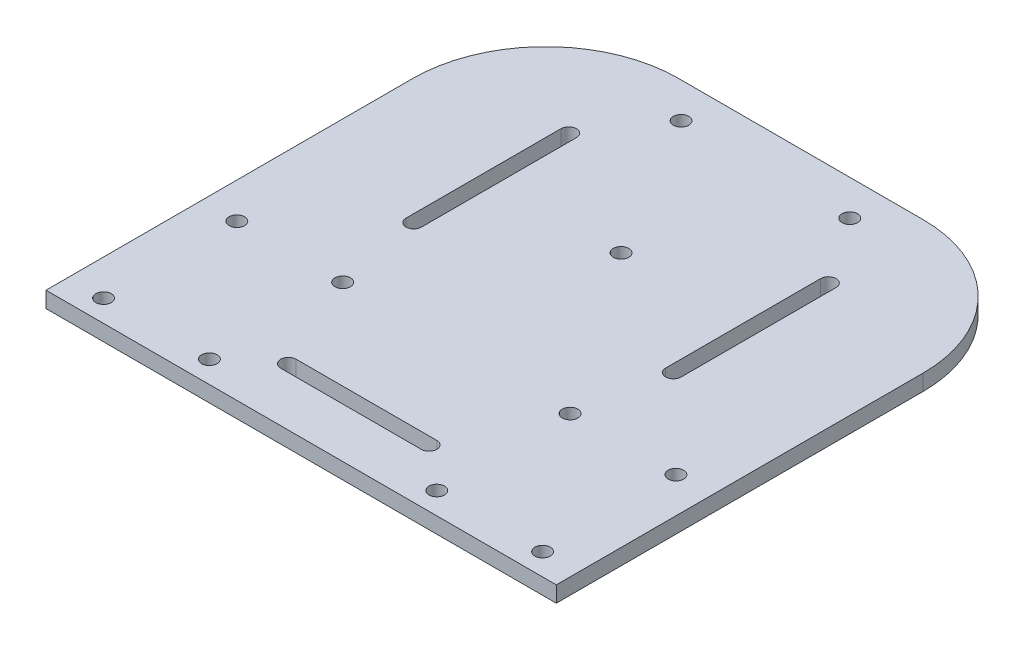
ISO-10303-21;
HEADER;
FILE_DESCRIPTION(('STEP AP214'),'2;1');
FILE_NAME('part.step','',(''),(''),'','','');
FILE_SCHEMA(('AUTOMOTIVE_DESIGN { 1 0 10303 214 1 1 1 1 }'));
ENDSEC;
DATA;
#1=APPLICATION_CONTEXT('core data for automotive mechanical design processes');
#2=APPLICATION_PROTOCOL_DEFINITION('international standard','automotive_design',2000,#1);
#3=PRODUCT_CONTEXT('',#1,'mechanical');
#4=PRODUCT('Part','Part','',(#3));
#5=PRODUCT_RELATED_PRODUCT_CATEGORY('part','',(#4));
#6=PRODUCT_DEFINITION_FORMATION('','',#4);
#7=PRODUCT_DEFINITION_CONTEXT('part definition',#1,'design');
#8=PRODUCT_DEFINITION('design','',#6,#7);
#9=PRODUCT_DEFINITION_SHAPE('','',#8);
#10=(LENGTH_UNIT() NAMED_UNIT(*) SI_UNIT(.MILLI.,.METRE.));
#11=(NAMED_UNIT(*) PLANE_ANGLE_UNIT() SI_UNIT($,.RADIAN.));
#12=(NAMED_UNIT(*) SI_UNIT($,.STERADIAN.) SOLID_ANGLE_UNIT());
#13=UNCERTAINTY_MEASURE_WITH_UNIT(LENGTH_MEASURE(1.E-05),#10,'distance_accuracy_value','');
#14=(GEOMETRIC_REPRESENTATION_CONTEXT(3) GLOBAL_UNCERTAINTY_ASSIGNED_CONTEXT((#13)) GLOBAL_UNIT_ASSIGNED_CONTEXT((#10,
#11,#12)) REPRESENTATION_CONTEXT('',''));
#15=CARTESIAN_POINT('',(0.,0.,0.));
#16=DIRECTION('',(0.,0.,1.));
#17=DIRECTION('',(1.,0.,0.));
#18=AXIS2_PLACEMENT_3D('',#15,#16,#17);
#19=CARTESIAN_POINT('',(122.627455900002,3.6,-110.));
#20=DIRECTION('',(0.,1.,0.));
#21=DIRECTION('',(0.,0.,1.));
#22=AXIS2_PLACEMENT_3D('',#19,#20,#21);
#23=CYLINDRICAL_SURFACE('',#22,30.);
#24=DIRECTION('',(0.,1.,0.));
#25=VECTOR('',#24,1.);
#26=CARTESIAN_POINT('',(152.627455900002,3.6,-110.));
#27=LINE('',#26,#25);
#28=CARTESIAN_POINT('',(152.627455900002,0.,-110.));
#29=VERTEX_POINT('',#28);
#30=CARTESIAN_POINT('',(152.627455900002,3.6,-110.));
#31=VERTEX_POINT('',#30);
#32=EDGE_CURVE('E164',#29,#31,#27,.T.);
#33=ORIENTED_EDGE('',*,*,#32,.F.);
#34=CARTESIAN_POINT('',(122.627455900002,0.,-110.));
#35=DIRECTION('',(0.,1.,0.));
#36=DIRECTION('',(0.,0.,1.));
#37=AXIS2_PLACEMENT_3D('',#34,#35,#36);
#38=CIRCLE('',#37,30.);
#39=CARTESIAN_POINT('',(122.627455900002,0.,-140.));
#40=VERTEX_POINT('',#39);
#41=EDGE_CURVE('E42',#40,#29,#38,.F.);
#42=ORIENTED_EDGE('',*,*,#41,.F.);
#43=DIRECTION('',(0.,1.,0.));
#44=VECTOR('',#43,1.);
#45=CARTESIAN_POINT('',(122.627455900002,3.6,-140.));
#46=LINE('',#45,#44);
#47=CARTESIAN_POINT('',(122.627455900002,3.6,-140.));
#48=VERTEX_POINT('',#47);
#49=EDGE_CURVE('E202',#48,#40,#46,.F.);
#50=ORIENTED_EDGE('',*,*,#49,.F.);
#51=CARTESIAN_POINT('',(122.627455900002,3.6,-110.));
#52=DIRECTION('',(0.,1.,0.));
#53=DIRECTION('',(0.,0.,1.));
#54=AXIS2_PLACEMENT_3D('',#51,#52,#53);
#55=CIRCLE('',#54,30.);
#56=EDGE_CURVE('E11',#31,#48,#55,.T.);
#57=ORIENTED_EDGE('',*,*,#56,.F.);
#58=EDGE_LOOP('',(#33,#42,#50,#57));
#59=FACE_BOUND('',#58,.T.);
#60=ADVANCED_FACE('F35',(#59),#23,.T.);
#61=CARTESIAN_POINT('',(67.372544100005,3.6,-110.));
#62=DIRECTION('',(0.,1.,0.));
#63=DIRECTION('',(0.,0.,1.));
#64=AXIS2_PLACEMENT_3D('',#61,#62,#63);
#65=CYLINDRICAL_SURFACE('',#64,30.);
#66=DIRECTION('',(0.,-1.,0.));
#67=VECTOR('',#66,1.);
#68=CARTESIAN_POINT('',(37.372544100005,3.6,-110.));
#69=LINE('',#68,#67);
#70=CARTESIAN_POINT('',(37.372544100005,3.6,-110.));
#71=VERTEX_POINT('',#70);
#72=CARTESIAN_POINT('',(37.372544100005,0.,-110.));
#73=VERTEX_POINT('',#72);
#74=EDGE_CURVE('E190',#71,#73,#69,.T.);
#75=ORIENTED_EDGE('',*,*,#74,.F.);
#76=CARTESIAN_POINT('',(67.372544100005,3.6,-110.));
#77=DIRECTION('',(0.,1.,0.));
#78=DIRECTION('',(0.,0.,1.));
#79=AXIS2_PLACEMENT_3D('',#76,#77,#78);
#80=CIRCLE('',#79,30.);
#81=CARTESIAN_POINT('',(67.372544100005,3.6,-140.));
#82=VERTEX_POINT('',#81);
#83=EDGE_CURVE('E197',#82,#71,#80,.T.);
#84=ORIENTED_EDGE('',*,*,#83,.F.);
#85=DIRECTION('',(0.,-1.,0.));
#86=VECTOR('',#85,1.);
#87=CARTESIAN_POINT('',(67.372544100005,3.6,-140.));
#88=LINE('',#87,#86);
#89=CARTESIAN_POINT('',(67.372544100005,0.,-140.));
#90=VERTEX_POINT('',#89);
#91=EDGE_CURVE('E193',#90,#82,#88,.F.);
#92=ORIENTED_EDGE('',*,*,#91,.F.);
#93=CARTESIAN_POINT('',(67.372544100005,0.,-110.));
#94=DIRECTION('',(0.,1.,0.));
#95=DIRECTION('',(0.,0.,1.));
#96=AXIS2_PLACEMENT_3D('',#93,#94,#95);
#97=CIRCLE('',#96,30.);
#98=EDGE_CURVE('E199',#73,#90,#97,.F.);
#99=ORIENTED_EDGE('',*,*,#98,.F.);
#100=EDGE_LOOP('',(#75,#84,#92,#99));
#101=FACE_BOUND('',#100,.T.);
#102=ADVANCED_FACE('F402',(#101),#65,.T.);
#103=CARTESIAN_POINT('',(122.570895734623,3.6,-8.26206257174868E-13));
#104=DIRECTION('',(-1.,0.,0.));
#105=DIRECTION('',(0.,0.,1.));
#106=AXIS2_PLACEMENT_3D('',#103,#104,#105);
#107=PLANE('',#106);
#108=DIRECTION('',(0.,0.,-1.));
#109=VECTOR('',#108,1.);
#110=CARTESIAN_POINT('',(122.570895734623,0.,-8.26206257174868E-13));
#111=LINE('',#110,#109);
#112=CARTESIAN_POINT('',(122.570895734622,0.,-81.8932949656048));
#113=VERTEX_POINT('',#112);
#114=CARTESIAN_POINT('',(122.570895734622,0.,-116.893294965605));
#115=VERTEX_POINT('',#114);
#116=EDGE_CURVE('E250',#113,#115,#111,.T.);
#117=ORIENTED_EDGE('',*,*,#116,.T.);
#118=DIRECTION('',(0.,-1.,0.));
#119=VECTOR('',#118,1.);
#120=CARTESIAN_POINT('',(122.570895734622,3.6,-116.893294965605));
#121=LINE('',#120,#119);
#122=CARTESIAN_POINT('',(122.570895734622,3.6,-116.893294965605));
#123=VERTEX_POINT('',#122);
#124=EDGE_CURVE('E194',#123,#115,#121,.T.);
#125=ORIENTED_EDGE('',*,*,#124,.F.);
#126=DIRECTION('',(0.,0.,-1.));
#127=VECTOR('',#126,1.);
#128=CARTESIAN_POINT('',(122.570895734623,3.6,-8.26206257174868E-13));
#129=LINE('',#128,#127);
#130=CARTESIAN_POINT('',(122.570895734622,3.6,-81.8932949656048));
#131=VERTEX_POINT('',#130);
#132=EDGE_CURVE('E354',#131,#123,#129,.T.);
#133=ORIENTED_EDGE('',*,*,#132,.F.);
#134=DIRECTION('',(0.,-1.,0.));
#135=VECTOR('',#134,1.);
#136=CARTESIAN_POINT('',(122.570895734622,3.6,-81.8932949656048));
#137=LINE('',#136,#135);
#138=EDGE_CURVE('E284',#131,#113,#137,.T.);
#139=ORIENTED_EDGE('',*,*,#138,.T.);
#140=EDGE_LOOP('',(#117,#125,#133,#139));
#141=FACE_BOUND('',#140,.T.);
#142=ADVANCED_FACE('F406',(#141),#107,.F.);
#143=CARTESIAN_POINT('',(124.320895734622,3.6,-116.893294965605));
#144=DIRECTION('',(0.,-1.,0.));
#145=DIRECTION('',(0.,0.,-1.));
#146=AXIS2_PLACEMENT_3D('',#143,#144,#145);
#147=CYLINDRICAL_SURFACE('',#146,1.74999999999975);
#148=CARTESIAN_POINT('',(124.320895734622,0.,-116.893294965605));
#149=DIRECTION('',(0.,1.,0.));
#150=DIRECTION('',(0.,0.,1.));
#151=AXIS2_PLACEMENT_3D('',#148,#149,#150);
#152=CIRCLE('',#151,1.74999999999975);
#153=CARTESIAN_POINT('',(126.070895734622,0.,-116.893294965605));
#154=VERTEX_POINT('',#153);
#155=EDGE_CURVE('E253',#115,#154,#152,.F.);
#156=ORIENTED_EDGE('',*,*,#155,.T.);
#157=DIRECTION('',(0.,-1.,0.));
#158=VECTOR('',#157,1.);
#159=CARTESIAN_POINT('',(126.070895734622,3.6,-116.893294965605));
#160=LINE('',#159,#158);
#161=CARTESIAN_POINT('',(126.070895734622,3.6,-116.893294965605));
#162=VERTEX_POINT('',#161);
#163=EDGE_CURVE('E290',#162,#154,#160,.T.);
#164=ORIENTED_EDGE('',*,*,#163,.F.);
#165=CARTESIAN_POINT('',(124.320895734622,3.6,-116.893294965605));
#166=DIRECTION('',(0.,1.,0.));
#167=DIRECTION('',(0.,0.,1.));
#168=AXIS2_PLACEMENT_3D('',#165,#166,#167);
#169=CIRCLE('',#168,1.74999999999975);
#170=EDGE_CURVE('E357',#123,#162,#169,.F.);
#171=ORIENTED_EDGE('',*,*,#170,.F.);
#172=ORIENTED_EDGE('',*,*,#124,.T.);
#173=EDGE_LOOP('',(#156,#164,#171,#172));
#174=FACE_BOUND('',#173,.T.);
#175=ADVANCED_FACE('F411',(#174),#147,.F.);
#176=CARTESIAN_POINT('',(126.070895734622,3.6,-8.99786643298041E-13));
#177=DIRECTION('',(-1.,0.,0.));
#178=DIRECTION('',(0.,0.,1.));
#179=AXIS2_PLACEMENT_3D('',#176,#177,#178);
#180=PLANE('',#179);
#181=DIRECTION('',(0.,0.,-1.));
#182=VECTOR('',#181,1.);
#183=CARTESIAN_POINT('',(126.070895734622,0.,-8.99786643298041E-13));
#184=LINE('',#183,#182);
#185=CARTESIAN_POINT('',(126.070895734622,0.,-81.8932949656048));
#186=VERTEX_POINT('',#185);
#187=EDGE_CURVE('E256',#186,#154,#184,.T.);
#188=ORIENTED_EDGE('',*,*,#187,.F.);
#189=DIRECTION('',(0.,-1.,0.));
#190=VECTOR('',#189,1.);
#191=CARTESIAN_POINT('',(126.070895734622,3.6,-81.8932949656048));
#192=LINE('',#191,#190);
#193=CARTESIAN_POINT('',(126.070895734622,3.6,-81.8932949656048));
#194=VERTEX_POINT('',#193);
#195=EDGE_CURVE('E287',#194,#186,#192,.T.);
#196=ORIENTED_EDGE('',*,*,#195,.F.);
#197=DIRECTION('',(0.,0.,-1.));
#198=VECTOR('',#197,1.);
#199=CARTESIAN_POINT('',(126.070895734622,3.6,-8.99786643298041E-13));
#200=LINE('',#199,#198);
#201=EDGE_CURVE('E359',#194,#162,#200,.T.);
#202=ORIENTED_EDGE('',*,*,#201,.T.);
#203=ORIENTED_EDGE('',*,*,#163,.T.);
#204=EDGE_LOOP('',(#188,#196,#202,#203));
#205=FACE_BOUND('',#204,.T.);
#206=ADVANCED_FACE('F452',(#205),#180,.T.);
#207=CARTESIAN_POINT('',(65.6791042653779,3.6,-116.893294965605));
#208=DIRECTION('',(0.,-1.,0.));
#209=DIRECTION('',(0.,0.,-1.));
#210=AXIS2_PLACEMENT_3D('',#207,#208,#209);
#211=CYLINDRICAL_SURFACE('',#210,1.74999999999975);
#212=CARTESIAN_POINT('',(65.6791042653779,0.,-116.893294965605));
#213=DIRECTION('',(0.,1.,0.));
#214=DIRECTION('',(0.,0.,1.));
#215=AXIS2_PLACEMENT_3D('',#212,#213,#214);
#216=CIRCLE('',#215,1.74999999999975);
#217=CARTESIAN_POINT('',(67.4291042653776,0.,-116.893294965605));
#218=VERTEX_POINT('',#217);
#219=CARTESIAN_POINT('',(63.9291042653781,0.,-116.893294965605));
#220=VERTEX_POINT('',#219);
#221=EDGE_CURVE('E235',#218,#220,#216,.T.);
#222=ORIENTED_EDGE('',*,*,#221,.F.);
#223=DIRECTION('',(0.,-1.,0.));
#224=VECTOR('',#223,1.);
#225=CARTESIAN_POINT('',(67.4291042653776,3.6,-116.893294965605));
#226=LINE('',#225,#224);
#227=CARTESIAN_POINT('',(67.4291042653776,3.6,-116.893294965605));
#228=VERTEX_POINT('',#227);
#229=EDGE_CURVE('E288',#228,#218,#226,.T.);
#230=ORIENTED_EDGE('',*,*,#229,.F.);
#231=CARTESIAN_POINT('',(65.6791042653779,3.6,-116.893294965605));
#232=DIRECTION('',(0.,1.,0.));
#233=DIRECTION('',(0.,0.,1.));
#234=AXIS2_PLACEMENT_3D('',#231,#232,#233);
#235=CIRCLE('',#234,1.74999999999975);
#236=CARTESIAN_POINT('',(63.9291042653781,3.6,-116.893294965605));
#237=VERTEX_POINT('',#236);
#238=EDGE_CURVE('E340',#228,#237,#235,.T.);
#239=ORIENTED_EDGE('',*,*,#238,.T.);
#240=DIRECTION('',(0.,-1.,0.));
#241=VECTOR('',#240,1.);
#242=CARTESIAN_POINT('',(63.9291042653781,3.6,-116.893294965605));
#243=LINE('',#242,#241);
#244=EDGE_CURVE('E294',#237,#220,#243,.T.);
#245=ORIENTED_EDGE('',*,*,#244,.T.);
#246=EDGE_LOOP('',(#222,#230,#239,#245));
#247=FACE_BOUND('',#246,.T.);
#248=ADVANCED_FACE('F448',(#247),#211,.F.);
#249=CARTESIAN_POINT('',(67.4291042653776,3.6,0.));
#250=DIRECTION('',(-1.,0.,0.));
#251=DIRECTION('',(0.,0.,1.));
#252=AXIS2_PLACEMENT_3D('',#249,#250,#251);
#253=PLANE('',#252);
#254=DIRECTION('',(0.,0.,-1.));
#255=VECTOR('',#254,1.);
#256=CARTESIAN_POINT('',(67.4291042653776,0.,0.));
#257=LINE('',#256,#255);
#258=CARTESIAN_POINT('',(67.4291042653776,0.,-81.8932949656048));
#259=VERTEX_POINT('',#258);
#260=EDGE_CURVE('E238',#259,#218,#257,.T.);
#261=ORIENTED_EDGE('',*,*,#260,.F.);
#262=DIRECTION('',(0.,-1.,0.));
#263=VECTOR('',#262,1.);
#264=CARTESIAN_POINT('',(67.4291042653776,3.6,-81.8932949656048));
#265=LINE('',#264,#263);
#266=CARTESIAN_POINT('',(67.4291042653776,3.6,-81.8932949656048));
#267=VERTEX_POINT('',#266);
#268=EDGE_CURVE('E299',#267,#259,#265,.T.);
#269=ORIENTED_EDGE('',*,*,#268,.F.);
#270=DIRECTION('',(0.,0.,-1.));
#271=VECTOR('',#270,1.);
#272=CARTESIAN_POINT('',(67.4291042653776,3.6,0.));
#273=LINE('',#272,#271);
#274=EDGE_CURVE('E343',#267,#228,#273,.T.);
#275=ORIENTED_EDGE('',*,*,#274,.T.);
#276=ORIENTED_EDGE('',*,*,#229,.T.);
#277=EDGE_LOOP('',(#261,#269,#275,#276));
#278=FACE_BOUND('',#277,.T.);
#279=ADVANCED_FACE('F451',(#278),#253,.T.);
#280=CARTESIAN_POINT('',(65.6791042653779,3.6,-81.8932949656048));
#281=DIRECTION('',(0.,-1.,0.));
#282=DIRECTION('',(0.,0.,-1.));
#283=AXIS2_PLACEMENT_3D('',#280,#281,#282);
#284=CYLINDRICAL_SURFACE('',#283,1.74999999999975);
#285=CARTESIAN_POINT('',(65.6791042653779,0.,-81.8932949656048));
#286=DIRECTION('',(0.,1.,0.));
#287=DIRECTION('',(0.,0.,1.));
#288=AXIS2_PLACEMENT_3D('',#285,#286,#287);
#289=CIRCLE('',#288,1.74999999999975);
#290=CARTESIAN_POINT('',(63.9291042653781,0.,-81.8932949656048));
#291=VERTEX_POINT('',#290);
#292=EDGE_CURVE('E241',#291,#259,#289,.T.);
#293=ORIENTED_EDGE('',*,*,#292,.F.);
#294=DIRECTION('',(0.,-1.,0.));
#295=VECTOR('',#294,1.);
#296=CARTESIAN_POINT('',(63.9291042653781,3.6,-81.8932949656048));
#297=LINE('',#296,#295);
#298=CARTESIAN_POINT('',(63.9291042653781,3.6,-81.8932949656048));
#299=VERTEX_POINT('',#298);
#300=EDGE_CURVE('E296',#299,#291,#297,.T.);
#301=ORIENTED_EDGE('',*,*,#300,.F.);
#302=CARTESIAN_POINT('',(65.6791042653779,3.6,-81.8932949656048));
#303=DIRECTION('',(0.,1.,0.));
#304=DIRECTION('',(0.,0.,1.));
#305=AXIS2_PLACEMENT_3D('',#302,#303,#304);
#306=CIRCLE('',#305,1.74999999999975);
#307=EDGE_CURVE('E346',#299,#267,#306,.T.);
#308=ORIENTED_EDGE('',*,*,#307,.T.);
#309=ORIENTED_EDGE('',*,*,#268,.T.);
#310=EDGE_LOOP('',(#293,#301,#308,#309));
#311=FACE_BOUND('',#310,.T.);
#312=ADVANCED_FACE('F431',(#311),#284,.F.);
#313=CARTESIAN_POINT('',(110.877455899999,3.6,-40.1432949656277));
#314=DIRECTION('',(0.,-1.,0.));
#315=DIRECTION('',(0.,0.,-1.));
#316=AXIS2_PLACEMENT_3D('',#313,#314,#315);
#317=CYLINDRICAL_SURFACE('',#316,1.75000000000342);
#318=CARTESIAN_POINT('',(110.877455899999,0.,-40.1432949656277));
#319=DIRECTION('',(0.,1.,0.));
#320=DIRECTION('',(0.,0.,1.));
#321=AXIS2_PLACEMENT_3D('',#318,#319,#320);
#322=CIRCLE('',#321,1.75000000000342);
#323=CARTESIAN_POINT('',(110.877455899999,0.,-38.3932949656243));
#324=VERTEX_POINT('',#323);
#325=CARTESIAN_POINT('',(110.877455899999,0.,-41.8932949656311));
#326=VERTEX_POINT('',#325);
#327=EDGE_CURVE('E217',#324,#326,#322,.T.);
#328=ORIENTED_EDGE('',*,*,#327,.F.);
#329=DIRECTION('',(0.,-1.,0.));
#330=VECTOR('',#329,1.);
#331=CARTESIAN_POINT('',(110.877455899999,3.6,-38.3932949656243));
#332=LINE('',#331,#330);
#333=CARTESIAN_POINT('',(110.877455899999,3.6,-38.3932949656243));
#334=VERTEX_POINT('',#333);
#335=EDGE_CURVE('E297',#334,#324,#332,.T.);
#336=ORIENTED_EDGE('',*,*,#335,.F.);
#337=CARTESIAN_POINT('',(110.877455899999,3.6,-40.1432949656277));
#338=DIRECTION('',(0.,1.,0.));
#339=DIRECTION('',(0.,0.,1.));
#340=AXIS2_PLACEMENT_3D('',#337,#338,#339);
#341=CIRCLE('',#340,1.75000000000342);
#342=CARTESIAN_POINT('',(110.877455899999,3.6,-41.8932949656311));
#343=VERTEX_POINT('',#342);
#344=EDGE_CURVE('E326',#334,#343,#341,.T.);
#345=ORIENTED_EDGE('',*,*,#344,.T.);
#346=DIRECTION('',(0.,-1.,0.));
#347=VECTOR('',#346,1.);
#348=CARTESIAN_POINT('',(110.877455899999,3.6,-41.8932949656311));
#349=LINE('',#348,#347);
#350=EDGE_CURVE('E181',#343,#326,#349,.T.);
#351=ORIENTED_EDGE('',*,*,#350,.T.);
#352=EDGE_LOOP('',(#328,#336,#345,#351));
#353=FACE_BOUND('',#352,.T.);
#354=ADVANCED_FACE('F314',(#353),#317,.F.);
#355=CARTESIAN_POINT('',(0.,3.6,-38.3932949656243));
#356=DIRECTION('',(0.,0.,-1.));
#357=DIRECTION('',(-1.,0.,0.));
#358=AXIS2_PLACEMENT_3D('',#355,#356,#357);
#359=PLANE('',#358);
#360=DIRECTION('',(1.,0.,0.));
#361=VECTOR('',#360,1.);
#362=CARTESIAN_POINT('',(0.,0.,-38.3932949656243));
#363=LINE('',#362,#361);
#364=CARTESIAN_POINT('',(79.1225441000075,0.,-38.3932949656243));
#365=VERTEX_POINT('',#364);
#366=EDGE_CURVE('E220',#365,#324,#363,.T.);
#367=ORIENTED_EDGE('',*,*,#366,.F.);
#368=DIRECTION('',(0.,-1.,0.));
#369=VECTOR('',#368,1.);
#370=CARTESIAN_POINT('',(79.1225441000075,3.6,-38.3932949656243));
#371=LINE('',#370,#369);
#372=CARTESIAN_POINT('',(79.1225441000075,3.6,-38.3932949656243));
#373=VERTEX_POINT('',#372);
#374=EDGE_CURVE('E303',#373,#365,#371,.T.);
#375=ORIENTED_EDGE('',*,*,#374,.F.);
#376=DIRECTION('',(1.,0.,0.));
#377=VECTOR('',#376,1.);
#378=CARTESIAN_POINT('',(0.,3.6,-38.3932949656243));
#379=LINE('',#378,#377);
#380=EDGE_CURVE('E310',#373,#334,#379,.T.);
#381=ORIENTED_EDGE('',*,*,#380,.T.);
#382=ORIENTED_EDGE('',*,*,#335,.T.);
#383=EDGE_LOOP('',(#367,#375,#381,#382));
#384=FACE_BOUND('',#383,.T.);
#385=ADVANCED_FACE('F308',(#384),#359,.T.);
#386=CARTESIAN_POINT('',(79.1225441000075,3.6,-40.1432949656277));
#387=DIRECTION('',(0.,-1.,0.));
#388=DIRECTION('',(0.,0.,-1.));
#389=AXIS2_PLACEMENT_3D('',#386,#387,#388);
#390=CYLINDRICAL_SURFACE('',#389,1.75000000000342);
#391=CARTESIAN_POINT('',(79.1225441000075,0.,-40.1432949656277));
#392=DIRECTION('',(0.,1.,0.));
#393=DIRECTION('',(0.,0.,1.));
#394=AXIS2_PLACEMENT_3D('',#391,#392,#393);
#395=CIRCLE('',#394,1.75000000000342);
#396=CARTESIAN_POINT('',(79.1225441000075,0.,-41.8932949656311));
#397=VERTEX_POINT('',#396);
#398=EDGE_CURVE('E223',#397,#365,#395,.T.);
#399=ORIENTED_EDGE('',*,*,#398,.F.);
#400=DIRECTION('',(0.,-1.,0.));
#401=VECTOR('',#400,1.);
#402=CARTESIAN_POINT('',(79.1225441000075,3.6,-41.8932949656311));
#403=LINE('',#402,#401);
#404=CARTESIAN_POINT('',(79.1225441000075,3.6,-41.8932949656311));
#405=VERTEX_POINT('',#404);
#406=EDGE_CURVE('E184',#405,#397,#403,.T.);
#407=ORIENTED_EDGE('',*,*,#406,.F.);
#408=CARTESIAN_POINT('',(79.1225441000075,3.6,-40.1432949656277));
#409=DIRECTION('',(0.,1.,0.));
#410=DIRECTION('',(0.,0.,1.));
#411=AXIS2_PLACEMENT_3D('',#408,#409,#410);
#412=CIRCLE('',#411,1.75000000000342);
#413=EDGE_CURVE('E324',#405,#373,#412,.T.);
#414=ORIENTED_EDGE('',*,*,#413,.T.);
#415=ORIENTED_EDGE('',*,*,#374,.T.);
#416=EDGE_LOOP('',(#399,#407,#414,#415));
#417=FACE_BOUND('',#416,.T.);
#418=ADVANCED_FACE('F320',(#417),#390,.F.);
#419=CARTESIAN_POINT('',(0.,3.6,-27.1432949656277));
#420=DIRECTION('',(0.,0.,-1.));
#421=DIRECTION('',(-1.,0.,0.));
#422=AXIS2_PLACEMENT_3D('',#419,#420,#421);
#423=PLANE('',#422);
#424=DIRECTION('',(1.,0.,0.));
#425=VECTOR('',#424,1.);
#426=CARTESIAN_POINT('',(0.,0.,-27.1432949656277));
#427=LINE('',#426,#425);
#428=CARTESIAN_POINT('',(37.372544100005,0.,-27.1432949656277));
#429=VERTEX_POINT('',#428);
#430=CARTESIAN_POINT('',(152.627455900002,0.,-27.1432949656277));
#431=VERTEX_POINT('',#430);
#432=EDGE_CURVE('E180',#429,#431,#427,.T.);
#433=ORIENTED_EDGE('',*,*,#432,.T.);
#434=DIRECTION('',(0.,-1.,0.));
#435=VECTOR('',#434,1.);
#436=CARTESIAN_POINT('',(152.627455900002,3.6,-27.1432949656277));
#437=LINE('',#436,#435);
#438=CARTESIAN_POINT('',(152.627455900002,3.6,-27.1432949656277));
#439=VERTEX_POINT('',#438);
#440=EDGE_CURVE('E162',#439,#431,#437,.T.);
#441=ORIENTED_EDGE('',*,*,#440,.F.);
#442=DIRECTION('',(1.,0.,0.));
#443=VECTOR('',#442,1.);
#444=CARTESIAN_POINT('',(0.,3.6,-27.1432949656277));
#445=LINE('',#444,#443);
#446=CARTESIAN_POINT('',(37.372544100005,3.6,-27.1432949656277));
#447=VERTEX_POINT('',#446);
#448=EDGE_CURVE('E166',#447,#439,#445,.T.);
#449=ORIENTED_EDGE('',*,*,#448,.F.);
#450=DIRECTION('',(0.,-1.,0.));
#451=VECTOR('',#450,1.);
#452=CARTESIAN_POINT('',(37.372544100005,3.6,-27.1432949656277));
#453=LINE('',#452,#451);
#454=EDGE_CURVE('E182',#447,#429,#453,.T.);
#455=ORIENTED_EDGE('',*,*,#454,.T.);
#456=EDGE_LOOP('',(#433,#441,#449,#455));
#457=FACE_BOUND('',#456,.T.);
#458=ADVANCED_FACE('F178',(#457),#423,.F.);
#459=CARTESIAN_POINT('',(152.627455900002,3.6,0.));
#460=DIRECTION('',(1.,0.,0.));
#461=DIRECTION('',(0.,0.,-1.));
#462=AXIS2_PLACEMENT_3D('',#459,#460,#461);
#463=PLANE('',#462);
#464=DIRECTION('',(0.,0.,1.));
#465=VECTOR('',#464,1.);
#466=CARTESIAN_POINT('',(152.627455900002,0.,0.));
#467=LINE('',#466,#465);
#468=EDGE_CURVE('E207',#29,#431,#467,.T.);
#469=ORIENTED_EDGE('',*,*,#468,.F.);
#470=ORIENTED_EDGE('',*,*,#32,.T.);
#471=DIRECTION('',(0.,0.,1.));
#472=VECTOR('',#471,1.);
#473=CARTESIAN_POINT('',(152.627455900002,3.6,0.));
#474=LINE('',#473,#472);
#475=EDGE_CURVE('E157',#31,#439,#474,.T.);
#476=ORIENTED_EDGE('',*,*,#475,.T.);
#477=ORIENTED_EDGE('',*,*,#440,.T.);
#478=EDGE_LOOP('',(#469,#470,#476,#477));
#479=FACE_BOUND('',#478,.T.);
#480=ADVANCED_FACE('F160',(#479),#463,.T.);
#481=CARTESIAN_POINT('',(0.,3.6,-140.));
#482=DIRECTION('',(0.,0.,-1.));
#483=DIRECTION('',(-1.,0.,0.));
#484=AXIS2_PLACEMENT_3D('',#481,#482,#483);
#485=PLANE('',#484);
#486=DIRECTION('',(1.,0.,0.));
#487=VECTOR('',#486,1.);
#488=CARTESIAN_POINT('',(0.,3.6,-140.));
#489=LINE('',#488,#487);
#490=EDGE_CURVE('E165',#82,#48,#489,.T.);
#491=ORIENTED_EDGE('',*,*,#490,.T.);
#492=ORIENTED_EDGE('',*,*,#49,.T.);
#493=DIRECTION('',(1.,0.,0.));
#494=VECTOR('',#493,1.);
#495=CARTESIAN_POINT('',(0.,0.,-140.));
#496=LINE('',#495,#494);
#497=EDGE_CURVE('E209',#90,#40,#496,.T.);
#498=ORIENTED_EDGE('',*,*,#497,.F.);
#499=ORIENTED_EDGE('',*,*,#91,.T.);
#500=EDGE_LOOP('',(#491,#492,#498,#499));
#501=FACE_BOUND('',#500,.T.);
#502=ADVANCED_FACE('F420',(#501),#485,.T.);
#503=CARTESIAN_POINT('',(120.677455900003,3.6,-32.0932949656051));
#504=DIRECTION('',(0.,-1.,0.));
#505=DIRECTION('',(0.,0.,-1.));
#506=AXIS2_PLACEMENT_3D('',#503,#504,#505);
#507=CYLINDRICAL_SURFACE('',#506,1.74999999999998);
#508=CARTESIAN_POINT('',(120.677455900003,3.6,-32.0932949656051));
#509=DIRECTION('',(0.,1.,0.));
#510=DIRECTION('',(0.,0.,1.));
#511=AXIS2_PLACEMENT_3D('',#508,#509,#510);
#512=CIRCLE('',#511,1.74999999999998);
#513=CARTESIAN_POINT('',(120.677455900003,3.6,-30.3432949656052));
#514=VERTEX_POINT('',#513);
#515=EDGE_CURVE('E382',#514,#514,#512,.T.);
#516=ORIENTED_EDGE('',*,*,#515,.T.);
#517=EDGE_LOOP('',(#516));
#518=FACE_BOUND('',#517,.T.);
#519=CARTESIAN_POINT('',(120.677455900003,0.,-32.0932949656051));
#520=DIRECTION('',(0.,1.,0.));
#521=DIRECTION('',(0.,0.,1.));
#522=AXIS2_PLACEMENT_3D('',#519,#520,#521);
#523=CIRCLE('',#522,1.74999999999998);
#524=CARTESIAN_POINT('',(120.677455900003,0.,-30.3432949656052));
#525=VERTEX_POINT('',#524);
#526=EDGE_CURVE('E279',#525,#525,#523,.T.);
#527=ORIENTED_EDGE('',*,*,#526,.F.);
#528=EDGE_LOOP('',(#527));
#529=FACE_BOUND('',#528,.T.);
#530=ADVANCED_FACE('F423',(#518,#529),#507,.F.);
#531=CARTESIAN_POINT('',(144.577455900003,3.6,-32.093294965605));
#532=DIRECTION('',(0.,-1.,0.));
#533=DIRECTION('',(0.,0.,-1.));
#534=AXIS2_PLACEMENT_3D('',#531,#532,#533);
#535=CYLINDRICAL_SURFACE('',#534,1.75000000000001);
#536=CARTESIAN_POINT('',(144.577455900003,3.6,-32.093294965605));
#537=DIRECTION('',(0.,1.,0.));
#538=DIRECTION('',(0.,0.,1.));
#539=AXIS2_PLACEMENT_3D('',#536,#537,#538);
#540=CIRCLE('',#539,1.75000000000001);
#541=CARTESIAN_POINT('',(144.577455900003,3.6,-30.343294965605));
#542=VERTEX_POINT('',#541);
#543=EDGE_CURVE('E379',#542,#542,#540,.T.);
#544=ORIENTED_EDGE('',*,*,#543,.T.);
#545=EDGE_LOOP('',(#544));
#546=FACE_BOUND('',#545,.T.);
#547=CARTESIAN_POINT('',(144.577455900003,0.,-32.093294965605));
#548=DIRECTION('',(0.,1.,0.));
#549=DIRECTION('',(0.,0.,1.));
#550=AXIS2_PLACEMENT_3D('',#547,#548,#549);
#551=CIRCLE('',#550,1.75000000000001);
#552=CARTESIAN_POINT('',(144.577455900003,0.,-30.343294965605));
#553=VERTEX_POINT('',#552);
#554=EDGE_CURVE('E276',#553,#553,#551,.T.);
#555=ORIENTED_EDGE('',*,*,#554,.F.);
#556=EDGE_LOOP('',(#555));
#557=FACE_BOUND('',#556,.T.);
#558=ADVANCED_FACE('F496',(#546,#557),#535,.F.);
#559=CARTESIAN_POINT('',(144.577455899996,3.6,-62.1932949656054));
#560=DIRECTION('',(0.,-1.,0.));
#561=DIRECTION('',(0.,0.,-1.));
#562=AXIS2_PLACEMENT_3D('',#559,#560,#561);
#563=CYLINDRICAL_SURFACE('',#562,1.74999999999998);
#564=CARTESIAN_POINT('',(144.577455899996,3.6,-62.1932949656054));
#565=DIRECTION('',(0.,1.,0.));
#566=DIRECTION('',(0.,0.,1.));
#567=AXIS2_PLACEMENT_3D('',#564,#565,#566);
#568=CIRCLE('',#567,1.74999999999998);
#569=CARTESIAN_POINT('',(144.577455899996,3.6,-60.4432949656054));
#570=VERTEX_POINT('',#569);
#571=EDGE_CURVE('E376',#570,#570,#568,.F.);
#572=ORIENTED_EDGE('',*,*,#571,.F.);
#573=EDGE_LOOP('',(#572));
#574=FACE_BOUND('',#573,.T.);
#575=CARTESIAN_POINT('',(144.577455899996,0.,-62.1932949656054));
#576=DIRECTION('',(0.,1.,0.));
#577=DIRECTION('',(0.,0.,1.));
#578=AXIS2_PLACEMENT_3D('',#575,#576,#577);
#579=CIRCLE('',#578,1.74999999999998);
#580=CARTESIAN_POINT('',(144.577455899996,0.,-60.4432949656054));
#581=VERTEX_POINT('',#580);
#582=EDGE_CURVE('E273',#581,#581,#579,.F.);
#583=ORIENTED_EDGE('',*,*,#582,.T.);
#584=EDGE_LOOP('',(#583));
#585=FACE_BOUND('',#584,.T.);
#586=ADVANCED_FACE('F492',(#574,#585),#563,.F.);
#587=CARTESIAN_POINT('',(45.4225440999975,3.6,-32.093294965605));
#588=DIRECTION('',(0.,-1.,0.));
#589=DIRECTION('',(0.,0.,-1.));
#590=AXIS2_PLACEMENT_3D('',#587,#588,#589);
#591=CYLINDRICAL_SURFACE('',#590,1.74999999999999);
#592=CARTESIAN_POINT('',(45.4225440999975,3.6,-32.093294965605));
#593=DIRECTION('',(0.,1.,0.));
#594=DIRECTION('',(0.,0.,1.));
#595=AXIS2_PLACEMENT_3D('',#592,#593,#594);
#596=CIRCLE('',#595,1.74999999999999);
#597=CARTESIAN_POINT('',(45.4225440999975,3.6,-30.343294965605));
#598=VERTEX_POINT('',#597);
#599=EDGE_CURVE('E373',#598,#598,#596,.F.);
#600=ORIENTED_EDGE('',*,*,#599,.F.);
#601=EDGE_LOOP('',(#600));
#602=FACE_BOUND('',#601,.T.);
#603=CARTESIAN_POINT('',(45.4225440999975,0.,-32.093294965605));
#604=DIRECTION('',(0.,1.,0.));
#605=DIRECTION('',(0.,0.,1.));
#606=AXIS2_PLACEMENT_3D('',#603,#604,#605);
#607=CIRCLE('',#606,1.74999999999999);
#608=CARTESIAN_POINT('',(45.4225440999975,0.,-30.343294965605));
#609=VERTEX_POINT('',#608);
#610=EDGE_CURVE('E270',#609,#609,#607,.F.);
#611=ORIENTED_EDGE('',*,*,#610,.T.);
#612=EDGE_LOOP('',(#611));
#613=FACE_BOUND('',#612,.T.);
#614=ADVANCED_FACE('F488',(#602,#613),#591,.F.);
#615=CARTESIAN_POINT('',(69.3225440999974,3.6,-62.1932949656054));
#616=DIRECTION('',(0.,-1.,0.));
#617=DIRECTION('',(0.,0.,-1.));
#618=AXIS2_PLACEMENT_3D('',#615,#616,#617);
#619=CYLINDRICAL_SURFACE('',#618,1.75);
#620=CARTESIAN_POINT('',(69.3225440999974,3.6,-62.1932949656054));
#621=DIRECTION('',(0.,1.,0.));
#622=DIRECTION('',(0.,0.,1.));
#623=AXIS2_PLACEMENT_3D('',#620,#621,#622);
#624=CIRCLE('',#623,1.75);
#625=CARTESIAN_POINT('',(69.3225440999974,3.6,-60.4432949656054));
#626=VERTEX_POINT('',#625);
#627=EDGE_CURVE('E370',#626,#626,#624,.T.);
#628=ORIENTED_EDGE('',*,*,#627,.T.);
#629=EDGE_LOOP('',(#628));
#630=FACE_BOUND('',#629,.T.);
#631=CARTESIAN_POINT('',(69.3225440999974,0.,-62.1932949656054));
#632=DIRECTION('',(0.,1.,0.));
#633=DIRECTION('',(0.,0.,1.));
#634=AXIS2_PLACEMENT_3D('',#631,#632,#633);
#635=CIRCLE('',#634,1.75);
#636=CARTESIAN_POINT('',(69.3225440999974,0.,-60.4432949656054));
#637=VERTEX_POINT('',#636);
#638=EDGE_CURVE('E267',#637,#637,#635,.T.);
#639=ORIENTED_EDGE('',*,*,#638,.F.);
#640=EDGE_LOOP('',(#639));
#641=FACE_BOUND('',#640,.T.);
#642=ADVANCED_FACE('F484',(#630,#641),#619,.F.);
#643=CARTESIAN_POINT('',(45.4225441000042,3.6,-62.1932949656054));
#644=DIRECTION('',(0.,-1.,0.));
#645=DIRECTION('',(0.,0.,-1.));
#646=AXIS2_PLACEMENT_3D('',#643,#644,#645);
#647=CYLINDRICAL_SURFACE('',#646,1.75);
#648=CARTESIAN_POINT('',(45.4225441000042,3.6,-62.1932949656054));
#649=DIRECTION('',(0.,1.,0.));
#650=DIRECTION('',(0.,0.,1.));
#651=AXIS2_PLACEMENT_3D('',#648,#649,#650);
#652=CIRCLE('',#651,1.75);
#653=CARTESIAN_POINT('',(45.4225441000042,3.6,-60.4432949656054));
#654=VERTEX_POINT('',#653);
#655=EDGE_CURVE('E367',#654,#654,#652,.T.);
#656=ORIENTED_EDGE('',*,*,#655,.T.);
#657=EDGE_LOOP('',(#656));
#658=FACE_BOUND('',#657,.T.);
#659=CARTESIAN_POINT('',(45.4225441000042,0.,-62.1932949656054));
#660=DIRECTION('',(0.,1.,0.));
#661=DIRECTION('',(0.,0.,1.));
#662=AXIS2_PLACEMENT_3D('',#659,#660,#661);
#663=CIRCLE('',#662,1.75);
#664=CARTESIAN_POINT('',(45.4225441000042,0.,-60.4432949656054));
#665=VERTEX_POINT('',#664);
#666=EDGE_CURVE('E264',#665,#665,#663,.T.);
#667=ORIENTED_EDGE('',*,*,#666,.F.);
#668=EDGE_LOOP('',(#667));
#669=FACE_BOUND('',#668,.T.);
#670=ADVANCED_FACE('F480',(#658,#669),#647,.F.);
#671=CARTESIAN_POINT('',(69.3225440999974,3.6,-32.0932949656049));
#672=DIRECTION('',(0.,-1.,0.));
#673=DIRECTION('',(0.,0.,-1.));
#674=AXIS2_PLACEMENT_3D('',#671,#672,#673);
#675=CYLINDRICAL_SURFACE('',#674,1.75);
#676=CARTESIAN_POINT('',(69.3225440999974,3.6,-32.0932949656049));
#677=DIRECTION('',(0.,1.,0.));
#678=DIRECTION('',(0.,0.,1.));
#679=AXIS2_PLACEMENT_3D('',#676,#677,#678);
#680=CIRCLE('',#679,1.75);
#681=CARTESIAN_POINT('',(69.3225440999974,3.6,-30.3432949656049));
#682=VERTEX_POINT('',#681);
#683=EDGE_CURVE('E364',#682,#682,#680,.F.);
#684=ORIENTED_EDGE('',*,*,#683,.F.);
#685=EDGE_LOOP('',(#684));
#686=FACE_BOUND('',#685,.T.);
#687=CARTESIAN_POINT('',(69.3225440999974,0.,-32.0932949656049));
#688=DIRECTION('',(0.,1.,0.));
#689=DIRECTION('',(0.,0.,1.));
#690=AXIS2_PLACEMENT_3D('',#687,#688,#689);
#691=CIRCLE('',#690,1.75);
#692=CARTESIAN_POINT('',(69.3225440999974,0.,-30.3432949656049));
#693=VERTEX_POINT('',#692);
#694=EDGE_CURVE('E261',#693,#693,#691,.F.);
#695=ORIENTED_EDGE('',*,*,#694,.T.);
#696=EDGE_LOOP('',(#695));
#697=FACE_BOUND('',#696,.T.);
#698=ADVANCED_FACE('F476',(#686,#697),#675,.F.);
#699=CARTESIAN_POINT('',(124.320895734622,3.6,-81.8932949656048));
#700=DIRECTION('',(0.,-1.,0.));
#701=DIRECTION('',(0.,0.,-1.));
#702=AXIS2_PLACEMENT_3D('',#699,#700,#701);
#703=CYLINDRICAL_SURFACE('',#702,1.74999999999976);
#704=CARTESIAN_POINT('',(124.320895734622,0.,-81.8932949656048));
#705=DIRECTION('',(0.,1.,0.));
#706=DIRECTION('',(0.,0.,1.));
#707=AXIS2_PLACEMENT_3D('',#704,#705,#706);
#708=CIRCLE('',#707,1.74999999999976);
#709=EDGE_CURVE('E259',#186,#113,#708,.F.);
#710=ORIENTED_EDGE('',*,*,#709,.T.);
#711=ORIENTED_EDGE('',*,*,#138,.F.);
#712=CARTESIAN_POINT('',(124.320895734622,3.6,-81.8932949656048));
#713=DIRECTION('',(0.,1.,0.));
#714=DIRECTION('',(0.,0.,1.));
#715=AXIS2_PLACEMENT_3D('',#712,#713,#714);
#716=CIRCLE('',#715,1.74999999999976);
#717=EDGE_CURVE('E362',#194,#131,#716,.F.);
#718=ORIENTED_EDGE('',*,*,#717,.F.);
#719=ORIENTED_EDGE('',*,*,#195,.T.);
#720=EDGE_LOOP('',(#710,#711,#718,#719));
#721=FACE_BOUND('',#720,.T.);
#722=ADVANCED_FACE('F465',(#721),#703,.F.);
#723=CARTESIAN_POINT('',(75.9500000000001,3.6,-132.));
#724=DIRECTION('',(0.,-1.,0.));
#725=DIRECTION('',(0.,0.,-1.));
#726=AXIS2_PLACEMENT_3D('',#723,#724,#725);
#727=CYLINDRICAL_SURFACE('',#726,1.75);
#728=CARTESIAN_POINT('',(75.9500000000001,3.6,-132.));
#729=DIRECTION('',(0.,1.,0.));
#730=DIRECTION('',(0.,0.,1.));
#731=AXIS2_PLACEMENT_3D('',#728,#729,#730);
#732=CIRCLE('',#731,1.75);
#733=CARTESIAN_POINT('',(75.9500000000001,3.6,-130.25));
#734=VERTEX_POINT('',#733);
#735=EDGE_CURVE('E351',#734,#734,#732,.T.);
#736=ORIENTED_EDGE('',*,*,#735,.T.);
#737=EDGE_LOOP('',(#736));
#738=FACE_BOUND('',#737,.T.);
#739=CARTESIAN_POINT('',(75.9500000000001,0.,-132.));
#740=DIRECTION('',(0.,1.,0.));
#741=DIRECTION('',(0.,0.,1.));
#742=AXIS2_PLACEMENT_3D('',#739,#740,#741);
#743=CIRCLE('',#742,1.75);
#744=CARTESIAN_POINT('',(75.9500000000001,0.,-130.25));
#745=VERTEX_POINT('',#744);
#746=EDGE_CURVE('E247',#745,#745,#743,.T.);
#747=ORIENTED_EDGE('',*,*,#746,.F.);
#748=EDGE_LOOP('',(#747));
#749=FACE_BOUND('',#748,.T.);
#750=ADVANCED_FACE('F462',(#738,#749),#727,.F.);
#751=CARTESIAN_POINT('',(63.9291042653781,3.6,0.));
#752=DIRECTION('',(-1.,0.,0.));
#753=DIRECTION('',(0.,0.,1.));
#754=AXIS2_PLACEMENT_3D('',#751,#752,#753);
#755=PLANE('',#754);
#756=DIRECTION('',(0.,0.,-1.));
#757=VECTOR('',#756,1.);
#758=CARTESIAN_POINT('',(63.9291042653781,0.,0.));
#759=LINE('',#758,#757);
#760=EDGE_CURVE('E244',#291,#220,#759,.T.);
#761=ORIENTED_EDGE('',*,*,#760,.T.);
#762=ORIENTED_EDGE('',*,*,#244,.F.);
#763=DIRECTION('',(0.,0.,-1.));
#764=VECTOR('',#763,1.);
#765=CARTESIAN_POINT('',(63.9291042653781,3.6,0.));
#766=LINE('',#765,#764);
#767=EDGE_CURVE('E349',#299,#237,#766,.T.);
#768=ORIENTED_EDGE('',*,*,#767,.F.);
#769=ORIENTED_EDGE('',*,*,#300,.T.);
#770=EDGE_LOOP('',(#761,#762,#768,#769));
#771=FACE_BOUND('',#770,.T.);
#772=ADVANCED_FACE('F446',(#771),#755,.F.);
#773=CARTESIAN_POINT('',(94.9999999999994,3.6,-99.3932949656066));
#774=DIRECTION('',(0.,-1.,0.));
#775=DIRECTION('',(0.,0.,-1.));
#776=AXIS2_PLACEMENT_3D('',#773,#774,#775);
#777=CYLINDRICAL_SURFACE('',#776,1.75);
#778=CARTESIAN_POINT('',(94.9999999999994,3.6,-99.3932949656066));
#779=DIRECTION('',(0.,1.,0.));
#780=DIRECTION('',(0.,0.,1.));
#781=AXIS2_PLACEMENT_3D('',#778,#779,#780);
#782=CIRCLE('',#781,1.75);
#783=CARTESIAN_POINT('',(94.9999999999994,3.6,-97.6432949656066));
#784=VERTEX_POINT('',#783);
#785=EDGE_CURVE('E337',#784,#784,#782,.T.);
#786=ORIENTED_EDGE('',*,*,#785,.T.);
#787=EDGE_LOOP('',(#786));
#788=FACE_BOUND('',#787,.T.);
#789=CARTESIAN_POINT('',(94.9999999999994,0.,-99.3932949656066));
#790=DIRECTION('',(0.,1.,0.));
#791=DIRECTION('',(0.,0.,1.));
#792=AXIS2_PLACEMENT_3D('',#789,#790,#791);
#793=CIRCLE('',#792,1.75);
#794=CARTESIAN_POINT('',(94.9999999999994,0.,-97.6432949656066));
#795=VERTEX_POINT('',#794);
#796=EDGE_CURVE('E232',#795,#795,#793,.T.);
#797=ORIENTED_EDGE('',*,*,#796,.F.);
#798=EDGE_LOOP('',(#797));
#799=FACE_BOUND('',#798,.T.);
#800=ADVANCED_FACE('F442',(#788,#799),#777,.F.);
#801=CARTESIAN_POINT('',(114.05,3.6,-132.));
#802=DIRECTION('',(0.,-1.,0.));
#803=DIRECTION('',(0.,0.,-1.));
#804=AXIS2_PLACEMENT_3D('',#801,#802,#803);
#805=CYLINDRICAL_SURFACE('',#804,1.75);
#806=CARTESIAN_POINT('',(114.05,3.6,-132.));
#807=DIRECTION('',(0.,1.,0.));
#808=DIRECTION('',(0.,0.,1.));
#809=AXIS2_PLACEMENT_3D('',#806,#807,#808);
#810=CIRCLE('',#809,1.75);
#811=CARTESIAN_POINT('',(114.05,3.6,-130.25));
#812=VERTEX_POINT('',#811);
#813=EDGE_CURVE('E334',#812,#812,#810,.F.);
#814=ORIENTED_EDGE('',*,*,#813,.F.);
#815=EDGE_LOOP('',(#814));
#816=FACE_BOUND('',#815,.T.);
#817=CARTESIAN_POINT('',(114.05,0.,-132.));
#818=DIRECTION('',(0.,1.,0.));
#819=DIRECTION('',(0.,0.,1.));
#820=AXIS2_PLACEMENT_3D('',#817,#818,#819);
#821=CIRCLE('',#820,1.75);
#822=CARTESIAN_POINT('',(114.05,0.,-130.25));
#823=VERTEX_POINT('',#822);
#824=EDGE_CURVE('E229',#823,#823,#821,.F.);
#825=ORIENTED_EDGE('',*,*,#824,.T.);
#826=EDGE_LOOP('',(#825));
#827=FACE_BOUND('',#826,.T.);
#828=ADVANCED_FACE('F438',(#816,#827),#805,.F.);
#829=CARTESIAN_POINT('',(0.,3.6,-41.8932949656311));
#830=DIRECTION('',(0.,0.,-1.));
#831=DIRECTION('',(-1.,0.,0.));
#832=AXIS2_PLACEMENT_3D('',#829,#830,#831);
#833=PLANE('',#832);
#834=DIRECTION('',(1.,0.,0.));
#835=VECTOR('',#834,1.);
#836=CARTESIAN_POINT('',(0.,0.,-41.8932949656311));
#837=LINE('',#836,#835);
#838=EDGE_CURVE('E226',#397,#326,#837,.T.);
#839=ORIENTED_EDGE('',*,*,#838,.T.);
#840=ORIENTED_EDGE('',*,*,#350,.F.);
#841=DIRECTION('',(1.,0.,0.));
#842=VECTOR('',#841,1.);
#843=CARTESIAN_POINT('',(0.,3.6,-41.8932949656311));
#844=LINE('',#843,#842);
#845=EDGE_CURVE('E328',#405,#343,#844,.T.);
#846=ORIENTED_EDGE('',*,*,#845,.F.);
#847=ORIENTED_EDGE('',*,*,#406,.T.);
#848=EDGE_LOOP('',(#839,#840,#846,#847));
#849=FACE_BOUND('',#848,.T.);
#850=ADVANCED_FACE('F427',(#849),#833,.F.);
#851=CARTESIAN_POINT('',(37.372544100005,3.6,0.));
#852=DIRECTION('',(1.,0.,0.));
#853=DIRECTION('',(0.,0.,-1.));
#854=AXIS2_PLACEMENT_3D('',#851,#852,#853);
#855=PLANE('',#854);
#856=DIRECTION('',(0.,0.,1.));
#857=VECTOR('',#856,1.);
#858=CARTESIAN_POINT('',(37.372544100005,3.6,0.));
#859=LINE('',#858,#857);
#860=EDGE_CURVE('E172',#71,#447,#859,.T.);
#861=ORIENTED_EDGE('',*,*,#860,.F.);
#862=ORIENTED_EDGE('',*,*,#74,.T.);
#863=DIRECTION('',(0.,0.,1.));
#864=VECTOR('',#863,1.);
#865=CARTESIAN_POINT('',(37.372544100005,0.,0.));
#866=LINE('',#865,#864);
#867=EDGE_CURVE('E211',#73,#429,#866,.T.);
#868=ORIENTED_EDGE('',*,*,#867,.T.);
#869=ORIENTED_EDGE('',*,*,#454,.F.);
#870=EDGE_LOOP('',(#861,#862,#868,#869));
#871=FACE_BOUND('',#870,.T.);
#872=ADVANCED_FACE('F391',(#871),#855,.F.);
#873=CARTESIAN_POINT('',(120.677455900003,3.6,-62.1932949656054));
#874=DIRECTION('',(0.,-1.,0.));
#875=DIRECTION('',(0.,0.,-1.));
#876=AXIS2_PLACEMENT_3D('',#873,#874,#875);
#877=CYLINDRICAL_SURFACE('',#876,1.75000000000001);
#878=CARTESIAN_POINT('',(120.677455900003,3.6,-62.1932949656054));
#879=DIRECTION('',(0.,1.,0.));
#880=DIRECTION('',(0.,0.,1.));
#881=AXIS2_PLACEMENT_3D('',#878,#879,#880);
#882=CIRCLE('',#881,1.75000000000001);
#883=CARTESIAN_POINT('',(120.677455900003,3.6,-60.4432949656054));
#884=VERTEX_POINT('',#883);
#885=EDGE_CURVE('E186',#884,#884,#882,.F.);
#886=ORIENTED_EDGE('',*,*,#885,.F.);
#887=EDGE_LOOP('',(#886));
#888=FACE_BOUND('',#887,.T.);
#889=CARTESIAN_POINT('',(120.677455900003,0.,-62.1932949656054));
#890=DIRECTION('',(0.,1.,0.));
#891=DIRECTION('',(0.,0.,1.));
#892=AXIS2_PLACEMENT_3D('',#889,#890,#891);
#893=CIRCLE('',#892,1.75000000000001);
#894=CARTESIAN_POINT('',(120.677455900003,0.,-60.4432949656054));
#895=VERTEX_POINT('',#894);
#896=EDGE_CURVE('E176',#895,#895,#893,.F.);
#897=ORIENTED_EDGE('',*,*,#896,.T.);
#898=EDGE_LOOP('',(#897));
#899=FACE_BOUND('',#898,.T.);
#900=ADVANCED_FACE('F388',(#888,#899),#877,.F.);
#901=CARTESIAN_POINT('',(0.,3.6,0.));
#902=DIRECTION('',(0.,1.,0.));
#903=DIRECTION('',(0.,0.,1.));
#904=AXIS2_PLACEMENT_3D('',#901,#902,#903);
#905=PLANE('',#904);
#906=ORIENTED_EDGE('',*,*,#475,.F.);
#907=ORIENTED_EDGE('',*,*,#56,.T.);
#908=ORIENTED_EDGE('',*,*,#490,.F.);
#909=ORIENTED_EDGE('',*,*,#83,.T.);
#910=ORIENTED_EDGE('',*,*,#860,.T.);
#911=ORIENTED_EDGE('',*,*,#448,.T.);
#912=EDGE_LOOP('',(#906,#907,#908,#909,#910,#911));
#913=FACE_BOUND('',#912,.T.);
#914=ORIENTED_EDGE('',*,*,#344,.F.);
#915=ORIENTED_EDGE('',*,*,#380,.F.);
#916=ORIENTED_EDGE('',*,*,#413,.F.);
#917=ORIENTED_EDGE('',*,*,#845,.T.);
#918=EDGE_LOOP('',(#914,#915,#916,#917));
#919=FACE_BOUND('',#918,.T.);
#920=ORIENTED_EDGE('',*,*,#813,.T.);
#921=EDGE_LOOP('',(#920));
#922=FACE_BOUND('',#921,.T.);
#923=ORIENTED_EDGE('',*,*,#785,.F.);
#924=EDGE_LOOP('',(#923));
#925=FACE_BOUND('',#924,.T.);
#926=ORIENTED_EDGE('',*,*,#238,.F.);
#927=ORIENTED_EDGE('',*,*,#274,.F.);
#928=ORIENTED_EDGE('',*,*,#307,.F.);
#929=ORIENTED_EDGE('',*,*,#767,.T.);
#930=EDGE_LOOP('',(#926,#927,#928,#929));
#931=FACE_BOUND('',#930,.T.);
#932=ORIENTED_EDGE('',*,*,#735,.F.);
#933=EDGE_LOOP('',(#932));
#934=FACE_BOUND('',#933,.T.);
#935=ORIENTED_EDGE('',*,*,#132,.T.);
#936=ORIENTED_EDGE('',*,*,#170,.T.);
#937=ORIENTED_EDGE('',*,*,#201,.F.);
#938=ORIENTED_EDGE('',*,*,#717,.T.);
#939=EDGE_LOOP('',(#935,#936,#937,#938));
#940=FACE_BOUND('',#939,.T.);
#941=ORIENTED_EDGE('',*,*,#683,.T.);
#942=EDGE_LOOP('',(#941));
#943=FACE_BOUND('',#942,.T.);
#944=ORIENTED_EDGE('',*,*,#655,.F.);
#945=EDGE_LOOP('',(#944));
#946=FACE_BOUND('',#945,.T.);
#947=ORIENTED_EDGE('',*,*,#627,.F.);
#948=EDGE_LOOP('',(#947));
#949=FACE_BOUND('',#948,.T.);
#950=ORIENTED_EDGE('',*,*,#599,.T.);
#951=EDGE_LOOP('',(#950));
#952=FACE_BOUND('',#951,.T.);
#953=ORIENTED_EDGE('',*,*,#571,.T.);
#954=EDGE_LOOP('',(#953));
#955=FACE_BOUND('',#954,.T.);
#956=ORIENTED_EDGE('',*,*,#543,.F.);
#957=EDGE_LOOP('',(#956));
#958=FACE_BOUND('',#957,.T.);
#959=ORIENTED_EDGE('',*,*,#515,.F.);
#960=EDGE_LOOP('',(#959));
#961=FACE_BOUND('',#960,.T.);
#962=ORIENTED_EDGE('',*,*,#885,.T.);
#963=EDGE_LOOP('',(#962));
#964=FACE_BOUND('',#963,.T.);
#965=ADVANCED_FACE('F169',(#913,#919,#922,#925,#931,#934,#940,#943,#946,#949,#952,#955,#958,
#961,#964),#905,.T.);
#966=CARTESIAN_POINT('',(0.,0.,0.));
#967=DIRECTION('',(0.,1.,0.));
#968=DIRECTION('',(0.,0.,1.));
#969=AXIS2_PLACEMENT_3D('',#966,#967,#968);
#970=PLANE('',#969);
#971=ORIENTED_EDGE('',*,*,#497,.T.);
#972=ORIENTED_EDGE('',*,*,#41,.T.);
#973=ORIENTED_EDGE('',*,*,#468,.T.);
#974=ORIENTED_EDGE('',*,*,#432,.F.);
#975=ORIENTED_EDGE('',*,*,#867,.F.);
#976=ORIENTED_EDGE('',*,*,#98,.T.);
#977=EDGE_LOOP('',(#971,#972,#973,#974,#975,#976));
#978=FACE_BOUND('',#977,.T.);
#979=ORIENTED_EDGE('',*,*,#327,.T.);
#980=ORIENTED_EDGE('',*,*,#838,.F.);
#981=ORIENTED_EDGE('',*,*,#398,.T.);
#982=ORIENTED_EDGE('',*,*,#366,.T.);
#983=EDGE_LOOP('',(#979,#980,#981,#982));
#984=FACE_BOUND('',#983,.T.);
#985=ORIENTED_EDGE('',*,*,#824,.F.);
#986=EDGE_LOOP('',(#985));
#987=FACE_BOUND('',#986,.T.);
#988=ORIENTED_EDGE('',*,*,#796,.T.);
#989=EDGE_LOOP('',(#988));
#990=FACE_BOUND('',#989,.T.);
#991=ORIENTED_EDGE('',*,*,#221,.T.);
#992=ORIENTED_EDGE('',*,*,#760,.F.);
#993=ORIENTED_EDGE('',*,*,#292,.T.);
#994=ORIENTED_EDGE('',*,*,#260,.T.);
#995=EDGE_LOOP('',(#991,#992,#993,#994));
#996=FACE_BOUND('',#995,.T.);
#997=ORIENTED_EDGE('',*,*,#746,.T.);
#998=EDGE_LOOP('',(#997));
#999=FACE_BOUND('',#998,.T.);
#1000=ORIENTED_EDGE('',*,*,#116,.F.);
#1001=ORIENTED_EDGE('',*,*,#709,.F.);
#1002=ORIENTED_EDGE('',*,*,#187,.T.);
#1003=ORIENTED_EDGE('',*,*,#155,.F.);
#1004=EDGE_LOOP('',(#1000,#1001,#1002,#1003));
#1005=FACE_BOUND('',#1004,.T.);
#1006=ORIENTED_EDGE('',*,*,#694,.F.);
#1007=EDGE_LOOP('',(#1006));
#1008=FACE_BOUND('',#1007,.T.);
#1009=ORIENTED_EDGE('',*,*,#666,.T.);
#1010=EDGE_LOOP('',(#1009));
#1011=FACE_BOUND('',#1010,.T.);
#1012=ORIENTED_EDGE('',*,*,#638,.T.);
#1013=EDGE_LOOP('',(#1012));
#1014=FACE_BOUND('',#1013,.T.);
#1015=ORIENTED_EDGE('',*,*,#610,.F.);
#1016=EDGE_LOOP('',(#1015));
#1017=FACE_BOUND('',#1016,.T.);
#1018=ORIENTED_EDGE('',*,*,#582,.F.);
#1019=EDGE_LOOP('',(#1018));
#1020=FACE_BOUND('',#1019,.T.);
#1021=ORIENTED_EDGE('',*,*,#554,.T.);
#1022=EDGE_LOOP('',(#1021));
#1023=FACE_BOUND('',#1022,.T.);
#1024=ORIENTED_EDGE('',*,*,#526,.T.);
#1025=EDGE_LOOP('',(#1024));
#1026=FACE_BOUND('',#1025,.T.);
#1027=ORIENTED_EDGE('',*,*,#896,.F.);
#1028=EDGE_LOOP('',(#1027));
#1029=FACE_BOUND('',#1028,.T.);
#1030=ADVANCED_FACE('F205',(#978,#984,#987,#990,#996,#999,#1005,#1008,#1011,#1014,#1017,#1020,
#1023,#1026,#1029),#970,.F.);
#1031=CLOSED_SHELL('',(#60,#102,#142,#175,#206,#248,#279,#312,#354,#385,#418,#458,#480,#502,
#530,#558,#586,#614,#642,#670,#698,#722,#750,#772,#800,#828,#850,#872,#900,#965,#1030));
#1032=MANIFOLD_SOLID_BREP('B2',#1031);
#1033=ADVANCED_BREP_SHAPE_REPRESENTATION('',(#18,#1032),#14);
#1034=SHAPE_DEFINITION_REPRESENTATION(#9,#1033);
ENDSEC;
END-ISO-10303-21;
